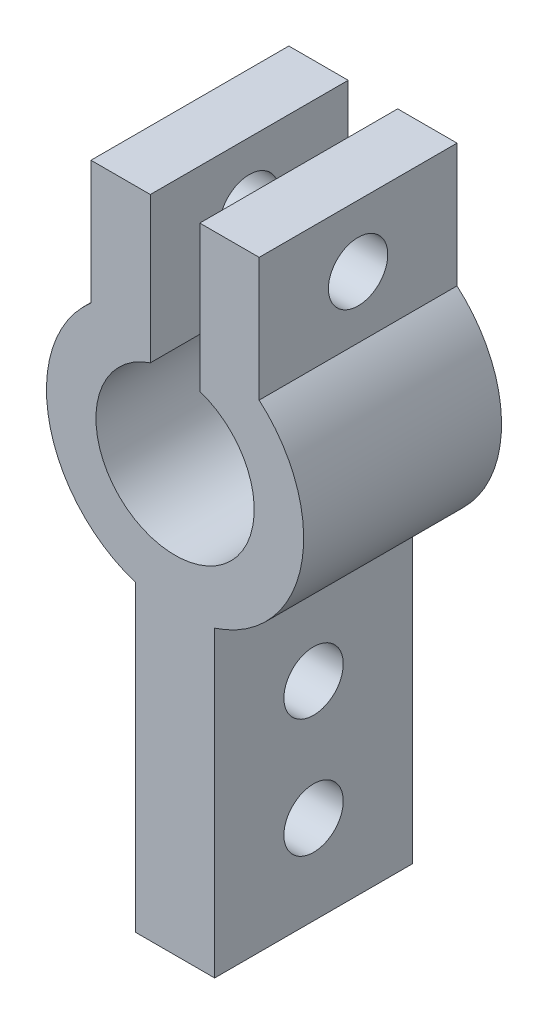
ISO-10303-21;
HEADER;
FILE_DESCRIPTION(('STEP AP214'),'2;1');
FILE_NAME('part.step','',(''),(''),'','','');
FILE_SCHEMA(('AUTOMOTIVE_DESIGN { 1 0 10303 214 1 1 1 1 }'));
ENDSEC;
DATA;
#1=APPLICATION_CONTEXT('core data for automotive mechanical design processes');
#2=APPLICATION_PROTOCOL_DEFINITION('international standard','automotive_design',2000,#1);
#3=PRODUCT_CONTEXT('',#1,'mechanical');
#4=PRODUCT('Part','Part','',(#3));
#5=PRODUCT_RELATED_PRODUCT_CATEGORY('part','',(#4));
#6=PRODUCT_DEFINITION_FORMATION('','',#4);
#7=PRODUCT_DEFINITION_CONTEXT('part definition',#1,'design');
#8=PRODUCT_DEFINITION('design','',#6,#7);
#9=PRODUCT_DEFINITION_SHAPE('','',#8);
#10=(LENGTH_UNIT() NAMED_UNIT(*) SI_UNIT(.MILLI.,.METRE.));
#11=(NAMED_UNIT(*) PLANE_ANGLE_UNIT() SI_UNIT($,.RADIAN.));
#12=(NAMED_UNIT(*) SI_UNIT($,.STERADIAN.) SOLID_ANGLE_UNIT());
#13=UNCERTAINTY_MEASURE_WITH_UNIT(LENGTH_MEASURE(1.E-05),#10,'distance_accuracy_value','');
#14=(GEOMETRIC_REPRESENTATION_CONTEXT(3) GLOBAL_UNCERTAINTY_ASSIGNED_CONTEXT((#13)) GLOBAL_UNIT_ASSIGNED_CONTEXT((#10,
#11,#12)) REPRESENTATION_CONTEXT('',''));
#15=CARTESIAN_POINT('',(0.,0.,0.));
#16=DIRECTION('',(0.,0.,1.));
#17=DIRECTION('',(1.,0.,0.));
#18=AXIS2_PLACEMENT_3D('',#15,#16,#17);
#19=CARTESIAN_POINT('',(2.,0.,10.));
#20=DIRECTION('',(1.,0.,0.));
#21=DIRECTION('',(0.,1.,0.));
#22=AXIS2_PLACEMENT_3D('',#19,#20,#21);
#23=PLANE('',#22);
#24=CARTESIAN_POINT('',(2.,-17.,5.));
#25=DIRECTION('',(1.,0.,0.));
#26=DIRECTION('',(0.,1.,0.));
#27=AXIS2_PLACEMENT_3D('',#24,#25,#26);
#28=CIRCLE('',#27,1.5);
#29=CARTESIAN_POINT('',(2.,-15.5,5.));
#30=VERTEX_POINT('',#29);
#31=EDGE_CURVE('E208',#30,#30,#28,.T.);
#32=ORIENTED_EDGE('',*,*,#31,.F.);
#33=EDGE_LOOP('',(#32));
#34=FACE_BOUND('',#33,.T.);
#35=CARTESIAN_POINT('',(2.,-11.,5.));
#36=DIRECTION('',(1.,0.,0.));
#37=DIRECTION('',(0.,1.,0.));
#38=AXIS2_PLACEMENT_3D('',#35,#36,#37);
#39=CIRCLE('',#38,1.5);
#40=CARTESIAN_POINT('',(2.,-9.5,5.));
#41=VERTEX_POINT('',#40);
#42=EDGE_CURVE('E205',#41,#41,#39,.T.);
#43=ORIENTED_EDGE('',*,*,#42,.F.);
#44=EDGE_LOOP('',(#43));
#45=FACE_BOUND('',#44,.T.);
#46=DIRECTION('',(0.,-1.,0.));
#47=VECTOR('',#46,1.);
#48=CARTESIAN_POINT('',(2.,0.,0.));
#49=LINE('',#48,#47);
#50=CARTESIAN_POINT('',(2.,-6.18465843842649,0.));
#51=VERTEX_POINT('',#50);
#52=CARTESIAN_POINT('',(2.,-21.5,0.));
#53=VERTEX_POINT('',#52);
#54=EDGE_CURVE('E153',#51,#53,#49,.T.);
#55=ORIENTED_EDGE('',*,*,#54,.F.);
#56=DIRECTION('',(0.,0.,-1.));
#57=VECTOR('',#56,1.);
#58=CARTESIAN_POINT('',(2.,-6.18465843842649,10.));
#59=LINE('',#58,#57);
#60=CARTESIAN_POINT('',(2.,-6.18465843842649,10.));
#61=VERTEX_POINT('',#60);
#62=EDGE_CURVE('E11',#61,#51,#59,.T.);
#63=ORIENTED_EDGE('',*,*,#62,.F.);
#64=DIRECTION('',(0.,-1.,0.));
#65=VECTOR('',#64,1.);
#66=CARTESIAN_POINT('',(2.,0.,10.));
#67=LINE('',#66,#65);
#68=CARTESIAN_POINT('',(2.,-21.5,10.));
#69=VERTEX_POINT('',#68);
#70=EDGE_CURVE('E183',#61,#69,#67,.T.);
#71=ORIENTED_EDGE('',*,*,#70,.T.);
#72=DIRECTION('',(0.,0.,-1.));
#73=VECTOR('',#72,1.);
#74=CARTESIAN_POINT('',(2.,-21.5,10.));
#75=LINE('',#74,#73);
#76=EDGE_CURVE('E51',#69,#53,#75,.T.);
#77=ORIENTED_EDGE('',*,*,#76,.T.);
#78=EDGE_LOOP('',(#55,#63,#71,#77));
#79=FACE_BOUND('',#78,.T.);
#80=ADVANCED_FACE('F33',(#34,#45,#79),#23,.T.);
#81=CARTESIAN_POINT('',(0.,0.,10.));
#82=DIRECTION('',(0.,0.,-1.));
#83=DIRECTION('',(-1.,0.,0.));
#84=AXIS2_PLACEMENT_3D('',#81,#82,#83);
#85=CYLINDRICAL_SURFACE('',#84,6.5);
#86=CARTESIAN_POINT('',(0.,0.,0.));
#87=DIRECTION('',(0.,0.,1.));
#88=DIRECTION('',(1.,0.,0.));
#89=AXIS2_PLACEMENT_3D('',#86,#87,#88);
#90=CIRCLE('',#89,6.5);
#91=CARTESIAN_POINT('',(4.25,4.9180788932265,0.));
#92=VERTEX_POINT('',#91);
#93=EDGE_CURVE('E155',#51,#92,#90,.T.);
#94=ORIENTED_EDGE('',*,*,#93,.T.);
#95=DIRECTION('',(0.,0.,-1.));
#96=VECTOR('',#95,1.);
#97=CARTESIAN_POINT('',(4.25,4.9180788932265,10.));
#98=LINE('',#97,#96);
#99=CARTESIAN_POINT('',(4.25,4.9180788932265,10.));
#100=VERTEX_POINT('',#99);
#101=EDGE_CURVE('E42',#100,#92,#98,.T.);
#102=ORIENTED_EDGE('',*,*,#101,.F.);
#103=CARTESIAN_POINT('',(0.,0.,10.));
#104=DIRECTION('',(0.,0.,1.));
#105=DIRECTION('',(1.,0.,0.));
#106=AXIS2_PLACEMENT_3D('',#103,#104,#105);
#107=CIRCLE('',#106,6.5);
#108=EDGE_CURVE('E227',#61,#100,#107,.T.);
#109=ORIENTED_EDGE('',*,*,#108,.F.);
#110=ORIENTED_EDGE('',*,*,#62,.T.);
#111=EDGE_LOOP('',(#94,#102,#109,#110));
#112=FACE_BOUND('',#111,.T.);
#113=ADVANCED_FACE('F262',(#112),#85,.T.);
#114=CARTESIAN_POINT('',(4.25,0.,10.));
#115=DIRECTION('',(-1.,0.,0.));
#116=DIRECTION('',(0.,0.,1.));
#117=AXIS2_PLACEMENT_3D('',#114,#115,#116);
#118=PLANE('',#117);
#119=CARTESIAN_POINT('',(4.25,8.0430788932265,5.));
#120=DIRECTION('',(-1.,0.,0.));
#121=DIRECTION('',(0.,0.,1.));
#122=AXIS2_PLACEMENT_3D('',#119,#120,#121);
#123=CIRCLE('',#122,1.5);
#124=CARTESIAN_POINT('',(4.25,8.0430788932265,6.5));
#125=VERTEX_POINT('',#124);
#126=EDGE_CURVE('E156',#125,#125,#123,.T.);
#127=ORIENTED_EDGE('',*,*,#126,.T.);
#128=EDGE_LOOP('',(#127));
#129=FACE_BOUND('',#128,.T.);
#130=DIRECTION('',(0.,1.,0.));
#131=VECTOR('',#130,1.);
#132=CARTESIAN_POINT('',(4.25,0.,0.));
#133=LINE('',#132,#131);
#134=CARTESIAN_POINT('',(4.25,11.1680788932265,0.));
#135=VERTEX_POINT('',#134);
#136=EDGE_CURVE('E158',#92,#135,#133,.T.);
#137=ORIENTED_EDGE('',*,*,#136,.T.);
#138=DIRECTION('',(0.,0.,-1.));
#139=VECTOR('',#138,1.);
#140=CARTESIAN_POINT('',(4.25,11.1680788932265,10.));
#141=LINE('',#140,#139);
#142=CARTESIAN_POINT('',(4.25,11.1680788932265,10.));
#143=VERTEX_POINT('',#142);
#144=EDGE_CURVE('E198',#143,#135,#141,.T.);
#145=ORIENTED_EDGE('',*,*,#144,.F.);
#146=DIRECTION('',(0.,1.,0.));
#147=VECTOR('',#146,1.);
#148=CARTESIAN_POINT('',(4.25,0.,10.));
#149=LINE('',#148,#147);
#150=EDGE_CURVE('E229',#100,#143,#149,.T.);
#151=ORIENTED_EDGE('',*,*,#150,.F.);
#152=ORIENTED_EDGE('',*,*,#101,.T.);
#153=EDGE_LOOP('',(#137,#145,#151,#152));
#154=FACE_BOUND('',#153,.T.);
#155=ADVANCED_FACE('F267',(#129,#154),#118,.F.);
#156=CARTESIAN_POINT('',(0.,11.1680788932265,10.));
#157=DIRECTION('',(0.,-1.,0.));
#158=DIRECTION('',(0.,0.,-1.));
#159=AXIS2_PLACEMENT_3D('',#156,#157,#158);
#160=PLANE('',#159);
#161=DIRECTION('',(-1.,0.,0.));
#162=VECTOR('',#161,1.);
#163=CARTESIAN_POINT('',(0.,11.1680788932265,0.));
#164=LINE('',#163,#162);
#165=CARTESIAN_POINT('',(1.25,11.1680788932265,0.));
#166=VERTEX_POINT('',#165);
#167=EDGE_CURVE('E160',#135,#166,#164,.T.);
#168=ORIENTED_EDGE('',*,*,#167,.T.);
#169=DIRECTION('',(0.,0.,-1.));
#170=VECTOR('',#169,1.);
#171=CARTESIAN_POINT('',(1.25,11.1680788932265,10.));
#172=LINE('',#171,#170);
#173=CARTESIAN_POINT('',(1.25,11.1680788932265,10.));
#174=VERTEX_POINT('',#173);
#175=EDGE_CURVE('E195',#174,#166,#172,.T.);
#176=ORIENTED_EDGE('',*,*,#175,.F.);
#177=DIRECTION('',(-1.,0.,0.));
#178=VECTOR('',#177,1.);
#179=CARTESIAN_POINT('',(0.,11.1680788932265,10.));
#180=LINE('',#179,#178);
#181=EDGE_CURVE('E231',#143,#174,#180,.T.);
#182=ORIENTED_EDGE('',*,*,#181,.F.);
#183=ORIENTED_EDGE('',*,*,#144,.T.);
#184=EDGE_LOOP('',(#168,#176,#182,#183));
#185=FACE_BOUND('',#184,.T.);
#186=ADVANCED_FACE('F326',(#185),#160,.F.);
#187=CARTESIAN_POINT('',(1.25,0.,10.));
#188=DIRECTION('',(1.,0.,0.));
#189=DIRECTION('',(0.,1.,0.));
#190=AXIS2_PLACEMENT_3D('',#187,#188,#189);
#191=PLANE('',#190);
#192=CARTESIAN_POINT('',(1.25,8.0430788932265,5.));
#193=DIRECTION('',(1.,0.,0.));
#194=DIRECTION('',(0.,1.,0.));
#195=AXIS2_PLACEMENT_3D('',#192,#193,#194);
#196=CIRCLE('',#195,1.5);
#197=CARTESIAN_POINT('',(1.25,9.5430788932265,5.));
#198=VERTEX_POINT('',#197);
#199=EDGE_CURVE('E221',#198,#198,#196,.T.);
#200=ORIENTED_EDGE('',*,*,#199,.T.);
#201=EDGE_LOOP('',(#200));
#202=FACE_BOUND('',#201,.T.);
#203=DIRECTION('',(0.,-1.,0.));
#204=VECTOR('',#203,1.);
#205=CARTESIAN_POINT('',(1.25,0.,0.));
#206=LINE('',#205,#204);
#207=CARTESIAN_POINT('',(1.25,3.79967103839267,0.));
#208=VERTEX_POINT('',#207);
#209=EDGE_CURVE('E162',#166,#208,#206,.T.);
#210=ORIENTED_EDGE('',*,*,#209,.T.);
#211=DIRECTION('',(0.,0.,-1.));
#212=VECTOR('',#211,1.);
#213=CARTESIAN_POINT('',(1.25,3.79967103839267,10.));
#214=LINE('',#213,#212);
#215=CARTESIAN_POINT('',(1.25,3.79967103839267,10.));
#216=VERTEX_POINT('',#215);
#217=EDGE_CURVE('E193',#216,#208,#214,.T.);
#218=ORIENTED_EDGE('',*,*,#217,.F.);
#219=DIRECTION('',(0.,-1.,0.));
#220=VECTOR('',#219,1.);
#221=CARTESIAN_POINT('',(1.25,0.,10.));
#222=LINE('',#221,#220);
#223=EDGE_CURVE('E233',#174,#216,#222,.T.);
#224=ORIENTED_EDGE('',*,*,#223,.F.);
#225=ORIENTED_EDGE('',*,*,#175,.T.);
#226=EDGE_LOOP('',(#210,#218,#224,#225));
#227=FACE_BOUND('',#226,.T.);
#228=ADVANCED_FACE('F340',(#202,#227),#191,.F.);
#229=CARTESIAN_POINT('',(0.,0.,10.));
#230=DIRECTION('',(0.,0.,-1.));
#231=DIRECTION('',(-1.,0.,0.));
#232=AXIS2_PLACEMENT_3D('',#229,#230,#231);
#233=CYLINDRICAL_SURFACE('',#232,4.);
#234=CARTESIAN_POINT('',(0.,0.,0.));
#235=DIRECTION('',(0.,0.,1.));
#236=DIRECTION('',(1.,0.,0.));
#237=AXIS2_PLACEMENT_3D('',#234,#235,#236);
#238=CIRCLE('',#237,4.);
#239=CARTESIAN_POINT('',(-1.25,3.79967103839267,0.));
#240=VERTEX_POINT('',#239);
#241=EDGE_CURVE('E165',#240,#208,#238,.T.);
#242=ORIENTED_EDGE('',*,*,#241,.F.);
#243=DIRECTION('',(0.,0.,-1.));
#244=VECTOR('',#243,1.);
#245=CARTESIAN_POINT('',(-1.25,3.79967103839267,10.));
#246=LINE('',#245,#244);
#247=CARTESIAN_POINT('',(-1.25,3.79967103839267,10.));
#248=VERTEX_POINT('',#247);
#249=EDGE_CURVE('E191',#248,#240,#246,.T.);
#250=ORIENTED_EDGE('',*,*,#249,.F.);
#251=CARTESIAN_POINT('',(0.,0.,10.));
#252=DIRECTION('',(0.,0.,1.));
#253=DIRECTION('',(1.,0.,0.));
#254=AXIS2_PLACEMENT_3D('',#251,#252,#253);
#255=CIRCLE('',#254,4.);
#256=EDGE_CURVE('E235',#248,#216,#255,.T.);
#257=ORIENTED_EDGE('',*,*,#256,.T.);
#258=ORIENTED_EDGE('',*,*,#217,.T.);
#259=EDGE_LOOP('',(#242,#250,#257,#258));
#260=FACE_BOUND('',#259,.T.);
#261=ADVANCED_FACE('F358',(#260),#233,.F.);
#262=CARTESIAN_POINT('',(-1.25,0.,10.));
#263=DIRECTION('',(1.,0.,0.));
#264=DIRECTION('',(0.,1.,0.));
#265=AXIS2_PLACEMENT_3D('',#262,#263,#264);
#266=PLANE('',#265);
#267=CARTESIAN_POINT('',(-1.25,8.0430788932265,5.));
#268=DIRECTION('',(1.,0.,0.));
#269=DIRECTION('',(0.,1.,0.));
#270=AXIS2_PLACEMENT_3D('',#267,#268,#269);
#271=CIRCLE('',#270,1.5);
#272=CARTESIAN_POINT('',(-1.25,9.5430788932265,5.));
#273=VERTEX_POINT('',#272);
#274=EDGE_CURVE('E218',#273,#273,#271,.T.);
#275=ORIENTED_EDGE('',*,*,#274,.F.);
#276=EDGE_LOOP('',(#275));
#277=FACE_BOUND('',#276,.T.);
#278=DIRECTION('',(0.,-1.,0.));
#279=VECTOR('',#278,1.);
#280=CARTESIAN_POINT('',(-1.25,0.,0.));
#281=LINE('',#280,#279);
#282=CARTESIAN_POINT('',(-1.25,11.1680788932265,0.));
#283=VERTEX_POINT('',#282);
#284=EDGE_CURVE('E168',#283,#240,#281,.T.);
#285=ORIENTED_EDGE('',*,*,#284,.F.);
#286=DIRECTION('',(0.,0.,-1.));
#287=VECTOR('',#286,1.);
#288=CARTESIAN_POINT('',(-1.25,11.1680788932265,10.));
#289=LINE('',#288,#287);
#290=CARTESIAN_POINT('',(-1.25,11.1680788932265,10.));
#291=VERTEX_POINT('',#290);
#292=EDGE_CURVE('E189',#291,#283,#289,.T.);
#293=ORIENTED_EDGE('',*,*,#292,.F.);
#294=DIRECTION('',(0.,-1.,0.));
#295=VECTOR('',#294,1.);
#296=CARTESIAN_POINT('',(-1.25,0.,10.));
#297=LINE('',#296,#295);
#298=EDGE_CURVE('E238',#291,#248,#297,.T.);
#299=ORIENTED_EDGE('',*,*,#298,.T.);
#300=ORIENTED_EDGE('',*,*,#249,.T.);
#301=EDGE_LOOP('',(#285,#293,#299,#300));
#302=FACE_BOUND('',#301,.T.);
#303=ADVANCED_FACE('F347',(#277,#302),#266,.T.);
#304=CARTESIAN_POINT('',(0.,11.1680788932265,10.));
#305=DIRECTION('',(0.,1.,0.));
#306=DIRECTION('',(0.,0.,1.));
#307=AXIS2_PLACEMENT_3D('',#304,#305,#306);
#308=PLANE('',#307);
#309=DIRECTION('',(1.,0.,0.));
#310=VECTOR('',#309,1.);
#311=CARTESIAN_POINT('',(0.,11.1680788932265,0.));
#312=LINE('',#311,#310);
#313=CARTESIAN_POINT('',(-4.25,11.1680788932265,0.));
#314=VERTEX_POINT('',#313);
#315=EDGE_CURVE('E171',#314,#283,#312,.T.);
#316=ORIENTED_EDGE('',*,*,#315,.F.);
#317=DIRECTION('',(0.,0.,-1.));
#318=VECTOR('',#317,1.);
#319=CARTESIAN_POINT('',(-4.25,11.1680788932265,10.));
#320=LINE('',#319,#318);
#321=CARTESIAN_POINT('',(-4.25,11.1680788932265,10.));
#322=VERTEX_POINT('',#321);
#323=EDGE_CURVE('E187',#322,#314,#320,.T.);
#324=ORIENTED_EDGE('',*,*,#323,.F.);
#325=DIRECTION('',(1.,0.,0.));
#326=VECTOR('',#325,1.);
#327=CARTESIAN_POINT('',(0.,11.1680788932265,10.));
#328=LINE('',#327,#326);
#329=EDGE_CURVE('E241',#322,#291,#328,.T.);
#330=ORIENTED_EDGE('',*,*,#329,.T.);
#331=ORIENTED_EDGE('',*,*,#292,.T.);
#332=EDGE_LOOP('',(#316,#324,#330,#331));
#333=FACE_BOUND('',#332,.T.);
#334=ADVANCED_FACE('F349',(#333),#308,.T.);
#335=CARTESIAN_POINT('',(-4.25,0.,10.));
#336=DIRECTION('',(-1.,0.,0.));
#337=DIRECTION('',(0.,0.,1.));
#338=AXIS2_PLACEMENT_3D('',#335,#336,#337);
#339=PLANE('',#338);
#340=CARTESIAN_POINT('',(-4.25,8.0430788932265,5.));
#341=DIRECTION('',(-1.,0.,0.));
#342=DIRECTION('',(0.,0.,1.));
#343=AXIS2_PLACEMENT_3D('',#340,#341,#342);
#344=CIRCLE('',#343,1.5);
#345=CARTESIAN_POINT('',(-4.25,8.0430788932265,6.5));
#346=VERTEX_POINT('',#345);
#347=EDGE_CURVE('E36',#346,#346,#344,.T.);
#348=ORIENTED_EDGE('',*,*,#347,.F.);
#349=EDGE_LOOP('',(#348));
#350=FACE_BOUND('',#349,.T.);
#351=DIRECTION('',(0.,1.,0.));
#352=VECTOR('',#351,1.);
#353=CARTESIAN_POINT('',(-4.25,0.,0.));
#354=LINE('',#353,#352);
#355=CARTESIAN_POINT('',(-4.25,4.9180788932265,0.));
#356=VERTEX_POINT('',#355);
#357=EDGE_CURVE('E174',#356,#314,#354,.T.);
#358=ORIENTED_EDGE('',*,*,#357,.F.);
#359=DIRECTION('',(0.,0.,-1.));
#360=VECTOR('',#359,1.);
#361=CARTESIAN_POINT('',(-4.25,4.9180788932265,10.));
#362=LINE('',#361,#360);
#363=CARTESIAN_POINT('',(-4.25,4.9180788932265,10.));
#364=VERTEX_POINT('',#363);
#365=EDGE_CURVE('E145',#364,#356,#362,.T.);
#366=ORIENTED_EDGE('',*,*,#365,.F.);
#367=DIRECTION('',(0.,1.,0.));
#368=VECTOR('',#367,1.);
#369=CARTESIAN_POINT('',(-4.25,0.,10.));
#370=LINE('',#369,#368);
#371=EDGE_CURVE('E135',#364,#322,#370,.T.);
#372=ORIENTED_EDGE('',*,*,#371,.T.);
#373=ORIENTED_EDGE('',*,*,#323,.T.);
#374=EDGE_LOOP('',(#358,#366,#372,#373));
#375=FACE_BOUND('',#374,.T.);
#376=ADVANCED_FACE('F245',(#350,#375),#339,.T.);
#377=CARTESIAN_POINT('',(0.,0.,10.));
#378=DIRECTION('',(0.,0.,-1.));
#379=DIRECTION('',(-1.,0.,0.));
#380=AXIS2_PLACEMENT_3D('',#377,#378,#379);
#381=CYLINDRICAL_SURFACE('',#380,6.5);
#382=CARTESIAN_POINT('',(0.,0.,0.));
#383=DIRECTION('',(0.,0.,1.));
#384=DIRECTION('',(1.,0.,0.));
#385=AXIS2_PLACEMENT_3D('',#382,#383,#384);
#386=CIRCLE('',#385,6.5);
#387=CARTESIAN_POINT('',(-2.,-6.18465843842649,0.));
#388=VERTEX_POINT('',#387);
#389=EDGE_CURVE('E142',#356,#388,#386,.T.);
#390=ORIENTED_EDGE('',*,*,#389,.T.);
#391=DIRECTION('',(0.,0.,-1.));
#392=VECTOR('',#391,1.);
#393=CARTESIAN_POINT('',(-2.,-6.18465843842649,10.));
#394=LINE('',#393,#392);
#395=CARTESIAN_POINT('',(-2.,-6.18465843842649,10.));
#396=VERTEX_POINT('',#395);
#397=EDGE_CURVE('E139',#396,#388,#394,.T.);
#398=ORIENTED_EDGE('',*,*,#397,.F.);
#399=CARTESIAN_POINT('',(0.,0.,10.));
#400=DIRECTION('',(0.,0.,1.));
#401=DIRECTION('',(1.,0.,0.));
#402=AXIS2_PLACEMENT_3D('',#399,#400,#401);
#403=CIRCLE('',#402,6.5);
#404=EDGE_CURVE('E126',#364,#396,#403,.T.);
#405=ORIENTED_EDGE('',*,*,#404,.F.);
#406=ORIENTED_EDGE('',*,*,#365,.T.);
#407=EDGE_LOOP('',(#390,#398,#405,#406));
#408=FACE_BOUND('',#407,.T.);
#409=ADVANCED_FACE('F140',(#408),#381,.T.);
#410=CARTESIAN_POINT('',(-2.,0.,10.));
#411=DIRECTION('',(-1.,0.,0.));
#412=DIRECTION('',(0.,-1.,0.));
#413=AXIS2_PLACEMENT_3D('',#410,#411,#412);
#414=PLANE('',#413);
#415=CARTESIAN_POINT('',(-2.,-17.,5.));
#416=DIRECTION('',(-1.,0.,0.));
#417=DIRECTION('',(0.,-1.,0.));
#418=AXIS2_PLACEMENT_3D('',#415,#416,#417);
#419=CIRCLE('',#418,1.5);
#420=CARTESIAN_POINT('',(-2.,-18.5,5.));
#421=VERTEX_POINT('',#420);
#422=EDGE_CURVE('E206',#421,#421,#419,.T.);
#423=ORIENTED_EDGE('',*,*,#422,.F.);
#424=EDGE_LOOP('',(#423));
#425=FACE_BOUND('',#424,.T.);
#426=CARTESIAN_POINT('',(-2.,-11.,5.));
#427=DIRECTION('',(-1.,0.,0.));
#428=DIRECTION('',(0.,-1.,0.));
#429=AXIS2_PLACEMENT_3D('',#426,#427,#428);
#430=CIRCLE('',#429,1.5);
#431=CARTESIAN_POINT('',(-2.,-12.5,5.));
#432=VERTEX_POINT('',#431);
#433=EDGE_CURVE('E203',#432,#432,#430,.T.);
#434=ORIENTED_EDGE('',*,*,#433,.F.);
#435=EDGE_LOOP('',(#434));
#436=FACE_BOUND('',#435,.T.);
#437=DIRECTION('',(0.,1.,0.));
#438=VECTOR('',#437,1.);
#439=CARTESIAN_POINT('',(-2.,0.,0.));
#440=LINE('',#439,#438);
#441=CARTESIAN_POINT('',(-2.,-21.5,0.));
#442=VERTEX_POINT('',#441);
#443=EDGE_CURVE('E178',#442,#388,#440,.T.);
#444=ORIENTED_EDGE('',*,*,#443,.F.);
#445=DIRECTION('',(0.,0.,-1.));
#446=VECTOR('',#445,1.);
#447=CARTESIAN_POINT('',(-2.,-21.5,10.));
#448=LINE('',#447,#446);
#449=CARTESIAN_POINT('',(-2.,-21.5,10.));
#450=VERTEX_POINT('',#449);
#451=EDGE_CURVE('E88',#450,#442,#448,.T.);
#452=ORIENTED_EDGE('',*,*,#451,.F.);
#453=DIRECTION('',(0.,1.,0.));
#454=VECTOR('',#453,1.);
#455=CARTESIAN_POINT('',(-2.,0.,10.));
#456=LINE('',#455,#454);
#457=EDGE_CURVE('E132',#450,#396,#456,.T.);
#458=ORIENTED_EDGE('',*,*,#457,.T.);
#459=ORIENTED_EDGE('',*,*,#397,.T.);
#460=EDGE_LOOP('',(#444,#452,#458,#459));
#461=FACE_BOUND('',#460,.T.);
#462=ADVANCED_FACE('F147',(#425,#436,#461),#414,.T.);
#463=CARTESIAN_POINT('',(0.,-21.5,10.));
#464=DIRECTION('',(0.,-1.,0.));
#465=DIRECTION('',(0.,0.,-1.));
#466=AXIS2_PLACEMENT_3D('',#463,#464,#465);
#467=PLANE('',#466);
#468=DIRECTION('',(-1.,0.,0.));
#469=VECTOR('',#468,1.);
#470=CARTESIAN_POINT('',(0.,-21.5,0.));
#471=LINE('',#470,#469);
#472=EDGE_CURVE('E180',#53,#442,#471,.T.);
#473=ORIENTED_EDGE('',*,*,#472,.F.);
#474=ORIENTED_EDGE('',*,*,#76,.F.);
#475=DIRECTION('',(-1.,0.,0.));
#476=VECTOR('',#475,1.);
#477=CARTESIAN_POINT('',(0.,-21.5,10.));
#478=LINE('',#477,#476);
#479=EDGE_CURVE('E148',#69,#450,#478,.T.);
#480=ORIENTED_EDGE('',*,*,#479,.T.);
#481=ORIENTED_EDGE('',*,*,#451,.T.);
#482=EDGE_LOOP('',(#473,#474,#480,#481));
#483=FACE_BOUND('',#482,.T.);
#484=ADVANCED_FACE('F250',(#483),#467,.T.);
#485=CARTESIAN_POINT('',(0.,0.,10.));
#486=DIRECTION('',(0.,0.,1.));
#487=DIRECTION('',(1.,0.,0.));
#488=AXIS2_PLACEMENT_3D('',#485,#486,#487);
#489=PLANE('',#488);
#490=ORIENTED_EDGE('',*,*,#70,.F.);
#491=ORIENTED_EDGE('',*,*,#108,.T.);
#492=ORIENTED_EDGE('',*,*,#150,.T.);
#493=ORIENTED_EDGE('',*,*,#181,.T.);
#494=ORIENTED_EDGE('',*,*,#223,.T.);
#495=ORIENTED_EDGE('',*,*,#256,.F.);
#496=ORIENTED_EDGE('',*,*,#298,.F.);
#497=ORIENTED_EDGE('',*,*,#329,.F.);
#498=ORIENTED_EDGE('',*,*,#371,.F.);
#499=ORIENTED_EDGE('',*,*,#404,.T.);
#500=ORIENTED_EDGE('',*,*,#457,.F.);
#501=ORIENTED_EDGE('',*,*,#479,.F.);
#502=EDGE_LOOP('',(#490,#491,#492,#493,#494,#495,#496,#497,#498,#499,#500,#501));
#503=FACE_BOUND('',#502,.T.);
#504=ADVANCED_FACE('F129',(#503),#489,.T.);
#505=CARTESIAN_POINT('',(0.,0.,0.));
#506=DIRECTION('',(0.,0.,1.));
#507=DIRECTION('',(1.,0.,0.));
#508=AXIS2_PLACEMENT_3D('',#505,#506,#507);
#509=PLANE('',#508);
#510=ORIENTED_EDGE('',*,*,#54,.T.);
#511=ORIENTED_EDGE('',*,*,#472,.T.);
#512=ORIENTED_EDGE('',*,*,#443,.T.);
#513=ORIENTED_EDGE('',*,*,#389,.F.);
#514=ORIENTED_EDGE('',*,*,#357,.T.);
#515=ORIENTED_EDGE('',*,*,#315,.T.);
#516=ORIENTED_EDGE('',*,*,#284,.T.);
#517=ORIENTED_EDGE('',*,*,#241,.T.);
#518=ORIENTED_EDGE('',*,*,#209,.F.);
#519=ORIENTED_EDGE('',*,*,#167,.F.);
#520=ORIENTED_EDGE('',*,*,#136,.F.);
#521=ORIENTED_EDGE('',*,*,#93,.F.);
#522=EDGE_LOOP('',(#510,#511,#512,#513,#514,#515,#516,#517,#518,#519,#520,#521));
#523=FACE_BOUND('',#522,.T.);
#524=ADVANCED_FACE('F248',(#523),#509,.F.);
#525=CARTESIAN_POINT('',(-6.5,-11.,5.));
#526=DIRECTION('',(1.,0.,0.));
#527=DIRECTION('',(0.,0.,-1.));
#528=AXIS2_PLACEMENT_3D('',#525,#526,#527);
#529=CYLINDRICAL_SURFACE('',#528,1.5);
#530=ORIENTED_EDGE('',*,*,#42,.T.);
#531=EDGE_LOOP('',(#530));
#532=FACE_BOUND('',#531,.T.);
#533=ORIENTED_EDGE('',*,*,#433,.T.);
#534=EDGE_LOOP('',(#533));
#535=FACE_BOUND('',#534,.T.);
#536=ADVANCED_FACE('F275',(#532,#535),#529,.F.);
#537=CARTESIAN_POINT('',(-6.5,-17.,5.));
#538=DIRECTION('',(1.,0.,0.));
#539=DIRECTION('',(0.,0.,-1.));
#540=AXIS2_PLACEMENT_3D('',#537,#538,#539);
#541=CYLINDRICAL_SURFACE('',#540,1.5);
#542=ORIENTED_EDGE('',*,*,#31,.T.);
#543=EDGE_LOOP('',(#542));
#544=FACE_BOUND('',#543,.T.);
#545=ORIENTED_EDGE('',*,*,#422,.T.);
#546=EDGE_LOOP('',(#545));
#547=FACE_BOUND('',#546,.T.);
#548=ADVANCED_FACE('F272',(#544,#547),#541,.F.);
#549=CARTESIAN_POINT('',(-6.5,8.0430788932265,5.));
#550=DIRECTION('',(1.,0.,0.));
#551=DIRECTION('',(0.,0.,-1.));
#552=AXIS2_PLACEMENT_3D('',#549,#550,#551);
#553=CYLINDRICAL_SURFACE('',#552,1.5);
#554=ORIENTED_EDGE('',*,*,#274,.T.);
#555=EDGE_LOOP('',(#554));
#556=FACE_BOUND('',#555,.T.);
#557=ORIENTED_EDGE('',*,*,#347,.T.);
#558=EDGE_LOOP('',(#557));
#559=FACE_BOUND('',#558,.T.);
#560=ADVANCED_FACE('F274',(#556,#559),#553,.F.);
#561=ORIENTED_EDGE('',*,*,#199,.F.);
#562=EDGE_LOOP('',(#561));
#563=FACE_BOUND('',#562,.T.);
#564=ORIENTED_EDGE('',*,*,#126,.F.);
#565=EDGE_LOOP('',(#564));
#566=FACE_BOUND('',#565,.T.);
#567=ADVANCED_FACE('F281',(#563,#566),#553,.F.);
#568=CLOSED_SHELL('',(#80,#113,#155,#186,#228,#261,#303,#334,#376,#409,#462,#484,#504,#524,#536,
#548,#560,#567));
#569=MANIFOLD_SOLID_BREP('B2',#568);
#570=ADVANCED_BREP_SHAPE_REPRESENTATION('',(#18,#569),#14);
#571=SHAPE_DEFINITION_REPRESENTATION(#9,#570);
ENDSEC;
END-ISO-10303-21;
